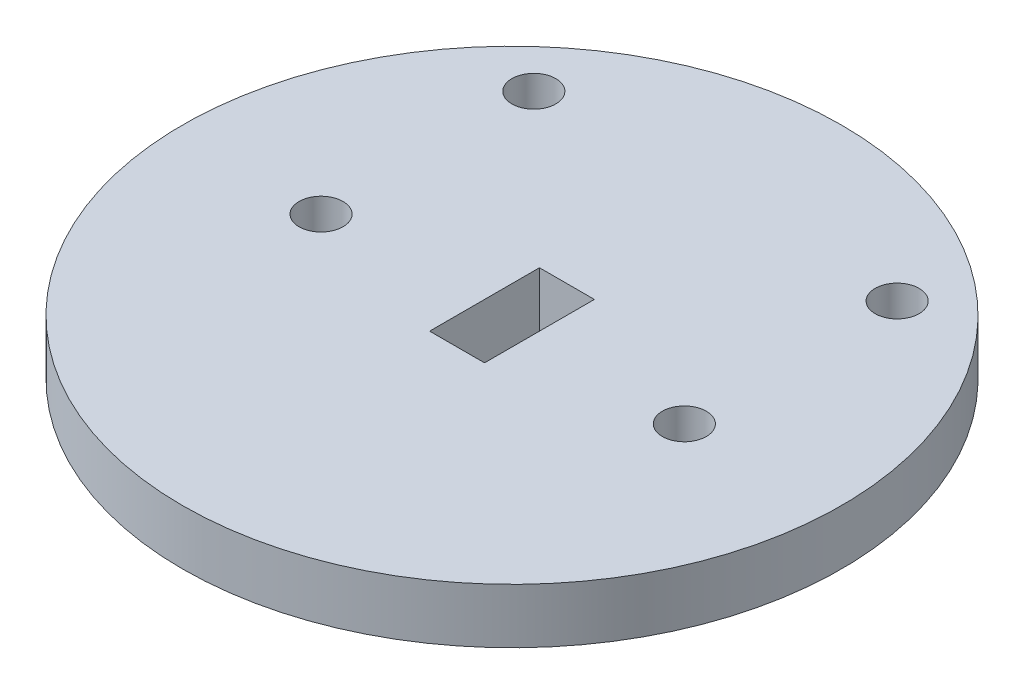
ISO-10303-21;
HEADER;
FILE_DESCRIPTION(('STEP AP214'),'2;1');
FILE_NAME('part.step','',(''),(''),'','','');
FILE_SCHEMA(('AUTOMOTIVE_DESIGN { 1 0 10303 214 1 1 1 1 }'));
ENDSEC;
DATA;
#1=APPLICATION_CONTEXT('core data for automotive mechanical design processes');
#2=APPLICATION_PROTOCOL_DEFINITION('international standard','automotive_design',2000,#1);
#3=PRODUCT_CONTEXT('',#1,'mechanical');
#4=PRODUCT('Part','Part','',(#3));
#5=PRODUCT_RELATED_PRODUCT_CATEGORY('part','',(#4));
#6=PRODUCT_DEFINITION_FORMATION('','',#4);
#7=PRODUCT_DEFINITION_CONTEXT('part definition',#1,'design');
#8=PRODUCT_DEFINITION('design','',#6,#7);
#9=PRODUCT_DEFINITION_SHAPE('','',#8);
#10=(LENGTH_UNIT() NAMED_UNIT(*) SI_UNIT(.MILLI.,.METRE.));
#11=(NAMED_UNIT(*) PLANE_ANGLE_UNIT() SI_UNIT($,.RADIAN.));
#12=(NAMED_UNIT(*) SI_UNIT($,.STERADIAN.) SOLID_ANGLE_UNIT());
#13=UNCERTAINTY_MEASURE_WITH_UNIT(LENGTH_MEASURE(1.E-05),#10,'distance_accuracy_value','');
#14=(GEOMETRIC_REPRESENTATION_CONTEXT(3) GLOBAL_UNCERTAINTY_ASSIGNED_CONTEXT((#13)) GLOBAL_UNIT_ASSIGNED_CONTEXT((#10,
#11,#12)) REPRESENTATION_CONTEXT('',''));
#15=CARTESIAN_POINT('',(0.,0.,0.));
#16=DIRECTION('',(0.,0.,1.));
#17=DIRECTION('',(1.,0.,0.));
#18=AXIS2_PLACEMENT_3D('',#15,#16,#17);
#19=CARTESIAN_POINT('',(0.,3.175,0.));
#20=DIRECTION('',(0.,1.,0.));
#21=DIRECTION('',(0.,0.,1.));
#22=AXIS2_PLACEMENT_3D('',#19,#20,#21);
#23=PLANE('',#22);
#24=CARTESIAN_POINT('',(10.4164173421877,3.175,-11.8454706463196));
#25=DIRECTION('',(0.,1.,0.));
#26=DIRECTION('',(0.,0.,1.));
#27=AXIS2_PLACEMENT_3D('',#24,#25,#26);
#28=CIRCLE('',#27,1.27);
#29=CARTESIAN_POINT('',(10.4164173421877,3.175,-10.5754706463196));
#30=VERTEX_POINT('',#29);
#31=EDGE_CURVE('E215',#30,#30,#28,.T.);
#32=ORIENTED_EDGE('',*,*,#31,.F.);
#33=EDGE_LOOP('',(#32));
#34=FACE_BOUND('',#33,.T.);
#35=CARTESIAN_POINT('',(-10.5835826578123,3.175,-11.8454706463196));
#36=DIRECTION('',(0.,1.,0.));
#37=DIRECTION('',(0.,0.,1.));
#38=AXIS2_PLACEMENT_3D('',#35,#36,#37);
#39=CIRCLE('',#38,1.27);
#40=CARTESIAN_POINT('',(-10.5835826578123,3.175,-10.5754706463196));
#41=VERTEX_POINT('',#40);
#42=EDGE_CURVE('E219',#41,#41,#39,.T.);
#43=ORIENTED_EDGE('',*,*,#42,.F.);
#44=EDGE_LOOP('',(#43));
#45=FACE_BOUND('',#44,.T.);
#46=CARTESIAN_POINT('',(-10.5835826578123,3.175,0.45452935368035));
#47=DIRECTION('',(0.,1.,0.));
#48=DIRECTION('',(0.,0.,1.));
#49=AXIS2_PLACEMENT_3D('',#46,#47,#48);
#50=CIRCLE('',#49,1.27);
#51=CARTESIAN_POINT('',(-10.5835826578123,3.175,1.72452935368035));
#52=VERTEX_POINT('',#51);
#53=EDGE_CURVE('E233',#52,#52,#50,.T.);
#54=ORIENTED_EDGE('',*,*,#53,.F.);
#55=EDGE_LOOP('',(#54));
#56=FACE_BOUND('',#55,.T.);
#57=CARTESIAN_POINT('',(10.4164173421877,3.175,0.454529353680358));
#58=DIRECTION('',(0.,1.,0.));
#59=DIRECTION('',(0.,0.,1.));
#60=AXIS2_PLACEMENT_3D('',#57,#58,#59);
#61=CIRCLE('',#60,1.27);
#62=CARTESIAN_POINT('',(10.4164173421877,3.175,1.72452935368036));
#63=VERTEX_POINT('',#62);
#64=EDGE_CURVE('E225',#63,#63,#61,.T.);
#65=ORIENTED_EDGE('',*,*,#64,.F.);
#66=EDGE_LOOP('',(#65));
#67=FACE_BOUND('',#66,.T.);
#68=CARTESIAN_POINT('',(0.,3.175,0.));
#69=DIRECTION('',(0.,1.,0.));
#70=DIRECTION('',(0.,0.,1.));
#71=AXIS2_PLACEMENT_3D('',#68,#69,#70);
#72=CIRCLE('',#71,19.05);
#73=CARTESIAN_POINT('',(0.,3.175,19.05));
#74=VERTEX_POINT('',#73);
#75=EDGE_CURVE('E11',#74,#74,#72,.T.);
#76=ORIENTED_EDGE('',*,*,#75,.T.);
#77=EDGE_LOOP('',(#76));
#78=FACE_BOUND('',#77,.T.);
#79=DIRECTION('',(-1.,0.,0.));
#80=VECTOR('',#79,1.);
#81=CARTESIAN_POINT('',(-1.5875,3.175,-3.175));
#82=LINE('',#81,#80);
#83=CARTESIAN_POINT('',(1.5875,3.175,-3.175));
#84=VERTEX_POINT('',#83);
#85=CARTESIAN_POINT('',(-1.5875,3.175,-3.175));
#86=VERTEX_POINT('',#85);
#87=EDGE_CURVE('E89',#84,#86,#82,.T.);
#88=ORIENTED_EDGE('',*,*,#87,.F.);
#89=DIRECTION('',(0.,0.,-1.));
#90=VECTOR('',#89,1.);
#91=CARTESIAN_POINT('',(1.5875,3.175,3.175));
#92=LINE('',#91,#90);
#93=CARTESIAN_POINT('',(1.5875,3.175,3.175));
#94=VERTEX_POINT('',#93);
#95=EDGE_CURVE('E80',#94,#84,#92,.T.);
#96=ORIENTED_EDGE('',*,*,#95,.F.);
#97=DIRECTION('',(1.,0.,0.));
#98=VECTOR('',#97,1.);
#99=CARTESIAN_POINT('',(-1.5875,3.175,3.175));
#100=LINE('',#99,#98);
#101=CARTESIAN_POINT('',(-1.5875,3.175,3.175));
#102=VERTEX_POINT('',#101);
#103=EDGE_CURVE('E105',#102,#94,#100,.T.);
#104=ORIENTED_EDGE('',*,*,#103,.F.);
#105=DIRECTION('',(0.,0.,1.));
#106=VECTOR('',#105,1.);
#107=CARTESIAN_POINT('',(-1.5875,3.175,3.175));
#108=LINE('',#107,#106);
#109=EDGE_CURVE('E101',#86,#102,#108,.T.);
#110=ORIENTED_EDGE('',*,*,#109,.F.);
#111=EDGE_LOOP('',(#88,#96,#104,#110));
#112=FACE_BOUND('',#111,.T.);
#113=ADVANCED_FACE('F38',(#34,#45,#56,#67,#78,#112),#23,.T.);
#114=CARTESIAN_POINT('',(0.,0.,0.));
#115=DIRECTION('',(0.,1.,0.));
#116=DIRECTION('',(0.,0.,1.));
#117=AXIS2_PLACEMENT_3D('',#114,#115,#116);
#118=PLANE('',#117);
#119=CARTESIAN_POINT('',(10.4164173421877,0.,-11.8454706463196));
#120=DIRECTION('',(0.,1.,0.));
#121=DIRECTION('',(0.,0.,1.));
#122=AXIS2_PLACEMENT_3D('',#119,#120,#121);
#123=CIRCLE('',#122,1.27);
#124=CARTESIAN_POINT('',(10.4164173421877,0.,-10.5754706463196));
#125=VERTEX_POINT('',#124);
#126=EDGE_CURVE('E213',#125,#125,#123,.T.);
#127=ORIENTED_EDGE('',*,*,#126,.T.);
#128=EDGE_LOOP('',(#127));
#129=FACE_BOUND('',#128,.T.);
#130=CARTESIAN_POINT('',(-10.5835826578123,0.,-11.8454706463196));
#131=DIRECTION('',(0.,1.,0.));
#132=DIRECTION('',(0.,0.,1.));
#133=AXIS2_PLACEMENT_3D('',#130,#131,#132);
#134=CIRCLE('',#133,1.27);
#135=CARTESIAN_POINT('',(-10.5835826578123,0.,-10.5754706463196));
#136=VERTEX_POINT('',#135);
#137=EDGE_CURVE('E239',#136,#136,#134,.T.);
#138=ORIENTED_EDGE('',*,*,#137,.T.);
#139=EDGE_LOOP('',(#138));
#140=FACE_BOUND('',#139,.T.);
#141=CARTESIAN_POINT('',(-10.5835826578123,0.,0.45452935368035));
#142=DIRECTION('',(0.,1.,0.));
#143=DIRECTION('',(0.,0.,1.));
#144=AXIS2_PLACEMENT_3D('',#141,#142,#143);
#145=CIRCLE('',#144,1.27);
#146=CARTESIAN_POINT('',(-10.5835826578123,0.,1.72452935368035));
#147=VERTEX_POINT('',#146);
#148=EDGE_CURVE('E228',#147,#147,#145,.T.);
#149=ORIENTED_EDGE('',*,*,#148,.T.);
#150=EDGE_LOOP('',(#149));
#151=FACE_BOUND('',#150,.T.);
#152=CARTESIAN_POINT('',(10.4164173421877,0.,0.454529353680358));
#153=DIRECTION('',(0.,1.,0.));
#154=DIRECTION('',(0.,0.,1.));
#155=AXIS2_PLACEMENT_3D('',#152,#153,#154);
#156=CIRCLE('',#155,1.27);
#157=CARTESIAN_POINT('',(10.4164173421877,0.,1.72452935368036));
#158=VERTEX_POINT('',#157);
#159=EDGE_CURVE('E113',#158,#158,#156,.T.);
#160=ORIENTED_EDGE('',*,*,#159,.T.);
#161=EDGE_LOOP('',(#160));
#162=FACE_BOUND('',#161,.T.);
#163=CARTESIAN_POINT('',(0.,0.,0.));
#164=DIRECTION('',(0.,1.,0.));
#165=DIRECTION('',(0.,0.,1.));
#166=AXIS2_PLACEMENT_3D('',#163,#164,#165);
#167=CIRCLE('',#166,19.05);
#168=CARTESIAN_POINT('',(0.,0.,19.05));
#169=VERTEX_POINT('',#168);
#170=EDGE_CURVE('E42',#169,#169,#167,.T.);
#171=ORIENTED_EDGE('',*,*,#170,.F.);
#172=EDGE_LOOP('',(#171));
#173=FACE_BOUND('',#172,.T.);
#174=DIRECTION('',(0.,0.,-1.));
#175=VECTOR('',#174,1.);
#176=CARTESIAN_POINT('',(1.5875,0.,3.175));
#177=LINE('',#176,#175);
#178=CARTESIAN_POINT('',(1.5875,0.,3.175));
#179=VERTEX_POINT('',#178);
#180=CARTESIAN_POINT('',(1.5875,0.,-3.175));
#181=VERTEX_POINT('',#180);
#182=EDGE_CURVE('E62',#179,#181,#177,.T.);
#183=ORIENTED_EDGE('',*,*,#182,.T.);
#184=DIRECTION('',(-1.,0.,0.));
#185=VECTOR('',#184,1.);
#186=CARTESIAN_POINT('',(-1.5875,0.,-3.175));
#187=LINE('',#186,#185);
#188=CARTESIAN_POINT('',(-1.5875,0.,-3.175));
#189=VERTEX_POINT('',#188);
#190=EDGE_CURVE('E96',#181,#189,#187,.T.);
#191=ORIENTED_EDGE('',*,*,#190,.T.);
#192=DIRECTION('',(0.,0.,1.));
#193=VECTOR('',#192,1.);
#194=CARTESIAN_POINT('',(-1.5875,0.,3.175));
#195=LINE('',#194,#193);
#196=CARTESIAN_POINT('',(-1.5875,0.,3.175));
#197=VERTEX_POINT('',#196);
#198=EDGE_CURVE('E116',#189,#197,#195,.T.);
#199=ORIENTED_EDGE('',*,*,#198,.T.);
#200=DIRECTION('',(1.,0.,0.));
#201=VECTOR('',#200,1.);
#202=CARTESIAN_POINT('',(-1.5875,0.,3.175));
#203=LINE('',#202,#201);
#204=EDGE_CURVE('E90',#197,#179,#203,.T.);
#205=ORIENTED_EDGE('',*,*,#204,.T.);
#206=EDGE_LOOP('',(#183,#191,#199,#205));
#207=FACE_BOUND('',#206,.T.);
#208=ADVANCED_FACE('F132',(#129,#140,#151,#162,#173,#207),#118,.F.);
#209=CARTESIAN_POINT('',(0.,3.175,0.));
#210=DIRECTION('',(0.,-1.,0.));
#211=DIRECTION('',(0.,0.,-1.));
#212=AXIS2_PLACEMENT_3D('',#209,#210,#211);
#213=CYLINDRICAL_SURFACE('',#212,19.05);
#214=ORIENTED_EDGE('',*,*,#75,.F.);
#215=EDGE_LOOP('',(#214));
#216=FACE_BOUND('',#215,.T.);
#217=ORIENTED_EDGE('',*,*,#170,.T.);
#218=EDGE_LOOP('',(#217));
#219=FACE_BOUND('',#218,.T.);
#220=ADVANCED_FACE('F40',(#216,#219),#213,.T.);
#221=CARTESIAN_POINT('',(1.5875,3.175,3.175));
#222=DIRECTION('',(-1.,0.,0.));
#223=DIRECTION('',(0.,0.,1.));
#224=AXIS2_PLACEMENT_3D('',#221,#222,#223);
#225=PLANE('',#224);
#226=ORIENTED_EDGE('',*,*,#182,.F.);
#227=DIRECTION('',(0.,-1.,0.));
#228=VECTOR('',#227,1.);
#229=CARTESIAN_POINT('',(1.5875,3.175,3.175));
#230=LINE('',#229,#228);
#231=EDGE_CURVE('E84',#94,#179,#230,.T.);
#232=ORIENTED_EDGE('',*,*,#231,.F.);
#233=ORIENTED_EDGE('',*,*,#95,.T.);
#234=DIRECTION('',(0.,-1.,0.));
#235=VECTOR('',#234,1.);
#236=CARTESIAN_POINT('',(1.5875,3.175,-3.175));
#237=LINE('',#236,#235);
#238=EDGE_CURVE('E83',#84,#181,#237,.T.);
#239=ORIENTED_EDGE('',*,*,#238,.T.);
#240=EDGE_LOOP('',(#226,#232,#233,#239));
#241=FACE_BOUND('',#240,.T.);
#242=ADVANCED_FACE('F82',(#241),#225,.T.);
#243=CARTESIAN_POINT('',(-1.5875,3.175,-3.175));
#244=DIRECTION('',(0.,0.,1.));
#245=DIRECTION('',(1.,0.,0.));
#246=AXIS2_PLACEMENT_3D('',#243,#244,#245);
#247=PLANE('',#246);
#248=ORIENTED_EDGE('',*,*,#190,.F.);
#249=ORIENTED_EDGE('',*,*,#238,.F.);
#250=ORIENTED_EDGE('',*,*,#87,.T.);
#251=DIRECTION('',(0.,-1.,0.));
#252=VECTOR('',#251,1.);
#253=CARTESIAN_POINT('',(-1.5875,3.175,-3.175));
#254=LINE('',#253,#252);
#255=EDGE_CURVE('E98',#86,#189,#254,.T.);
#256=ORIENTED_EDGE('',*,*,#255,.T.);
#257=EDGE_LOOP('',(#248,#249,#250,#256));
#258=FACE_BOUND('',#257,.T.);
#259=ADVANCED_FACE('F93',(#258),#247,.T.);
#260=CARTESIAN_POINT('',(-1.5875,3.175,3.175));
#261=DIRECTION('',(1.,0.,0.));
#262=DIRECTION('',(0.,0.,-1.));
#263=AXIS2_PLACEMENT_3D('',#260,#261,#262);
#264=PLANE('',#263);
#265=ORIENTED_EDGE('',*,*,#198,.F.);
#266=ORIENTED_EDGE('',*,*,#255,.F.);
#267=ORIENTED_EDGE('',*,*,#109,.T.);
#268=DIRECTION('',(0.,-1.,0.));
#269=VECTOR('',#268,1.);
#270=CARTESIAN_POINT('',(-1.5875,3.175,3.175));
#271=LINE('',#270,#269);
#272=EDGE_CURVE('E54',#102,#197,#271,.T.);
#273=ORIENTED_EDGE('',*,*,#272,.T.);
#274=EDGE_LOOP('',(#265,#266,#267,#273));
#275=FACE_BOUND('',#274,.T.);
#276=ADVANCED_FACE('F130',(#275),#264,.T.);
#277=CARTESIAN_POINT('',(-1.5875,3.175,3.175));
#278=DIRECTION('',(0.,0.,-1.));
#279=DIRECTION('',(-1.,0.,0.));
#280=AXIS2_PLACEMENT_3D('',#277,#278,#279);
#281=PLANE('',#280);
#282=ORIENTED_EDGE('',*,*,#204,.F.);
#283=ORIENTED_EDGE('',*,*,#272,.F.);
#284=ORIENTED_EDGE('',*,*,#103,.T.);
#285=ORIENTED_EDGE('',*,*,#231,.T.);
#286=EDGE_LOOP('',(#282,#283,#284,#285));
#287=FACE_BOUND('',#286,.T.);
#288=ADVANCED_FACE('F133',(#287),#281,.T.);
#289=CARTESIAN_POINT('',(10.4164173421877,0.,0.454529353680358));
#290=DIRECTION('',(0.,1.,0.));
#291=DIRECTION('',(0.,0.,1.));
#292=AXIS2_PLACEMENT_3D('',#289,#290,#291);
#293=CYLINDRICAL_SURFACE('',#292,1.27);
#294=ORIENTED_EDGE('',*,*,#159,.F.);
#295=EDGE_LOOP('',(#294));
#296=FACE_BOUND('',#295,.T.);
#297=ORIENTED_EDGE('',*,*,#64,.T.);
#298=EDGE_LOOP('',(#297));
#299=FACE_BOUND('',#298,.T.);
#300=ADVANCED_FACE('F135',(#296,#299),#293,.F.);
#301=CARTESIAN_POINT('',(-10.5835826578123,0.,0.45452935368035));
#302=DIRECTION('',(0.,1.,0.));
#303=DIRECTION('',(0.,0.,1.));
#304=AXIS2_PLACEMENT_3D('',#301,#302,#303);
#305=CYLINDRICAL_SURFACE('',#304,1.27);
#306=ORIENTED_EDGE('',*,*,#148,.F.);
#307=EDGE_LOOP('',(#306));
#308=FACE_BOUND('',#307,.T.);
#309=ORIENTED_EDGE('',*,*,#53,.T.);
#310=EDGE_LOOP('',(#309));
#311=FACE_BOUND('',#310,.T.);
#312=ADVANCED_FACE('F141',(#308,#311),#305,.F.);
#313=CARTESIAN_POINT('',(-10.5835826578123,0.,-11.8454706463196));
#314=DIRECTION('',(0.,1.,0.));
#315=DIRECTION('',(0.,0.,1.));
#316=AXIS2_PLACEMENT_3D('',#313,#314,#315);
#317=CYLINDRICAL_SURFACE('',#316,1.27);
#318=ORIENTED_EDGE('',*,*,#137,.F.);
#319=EDGE_LOOP('',(#318));
#320=FACE_BOUND('',#319,.T.);
#321=ORIENTED_EDGE('',*,*,#42,.T.);
#322=EDGE_LOOP('',(#321));
#323=FACE_BOUND('',#322,.T.);
#324=ADVANCED_FACE('F186',(#320,#323),#317,.F.);
#325=CARTESIAN_POINT('',(10.4164173421877,0.,-11.8454706463196));
#326=DIRECTION('',(0.,1.,0.));
#327=DIRECTION('',(0.,0.,1.));
#328=AXIS2_PLACEMENT_3D('',#325,#326,#327);
#329=CYLINDRICAL_SURFACE('',#328,1.27);
#330=ORIENTED_EDGE('',*,*,#126,.F.);
#331=EDGE_LOOP('',(#330));
#332=FACE_BOUND('',#331,.T.);
#333=ORIENTED_EDGE('',*,*,#31,.T.);
#334=EDGE_LOOP('',(#333));
#335=FACE_BOUND('',#334,.T.);
#336=ADVANCED_FACE('F195',(#332,#335),#329,.F.);
#337=CLOSED_SHELL('',(#113,#208,#220,#242,#259,#276,#288,#300,#312,#324,#336));
#338=MANIFOLD_SOLID_BREP('B2',#337);
#339=ADVANCED_BREP_SHAPE_REPRESENTATION('',(#18,#338),#14);
#340=SHAPE_DEFINITION_REPRESENTATION(#9,#339);
ENDSEC;
END-ISO-10303-21;
